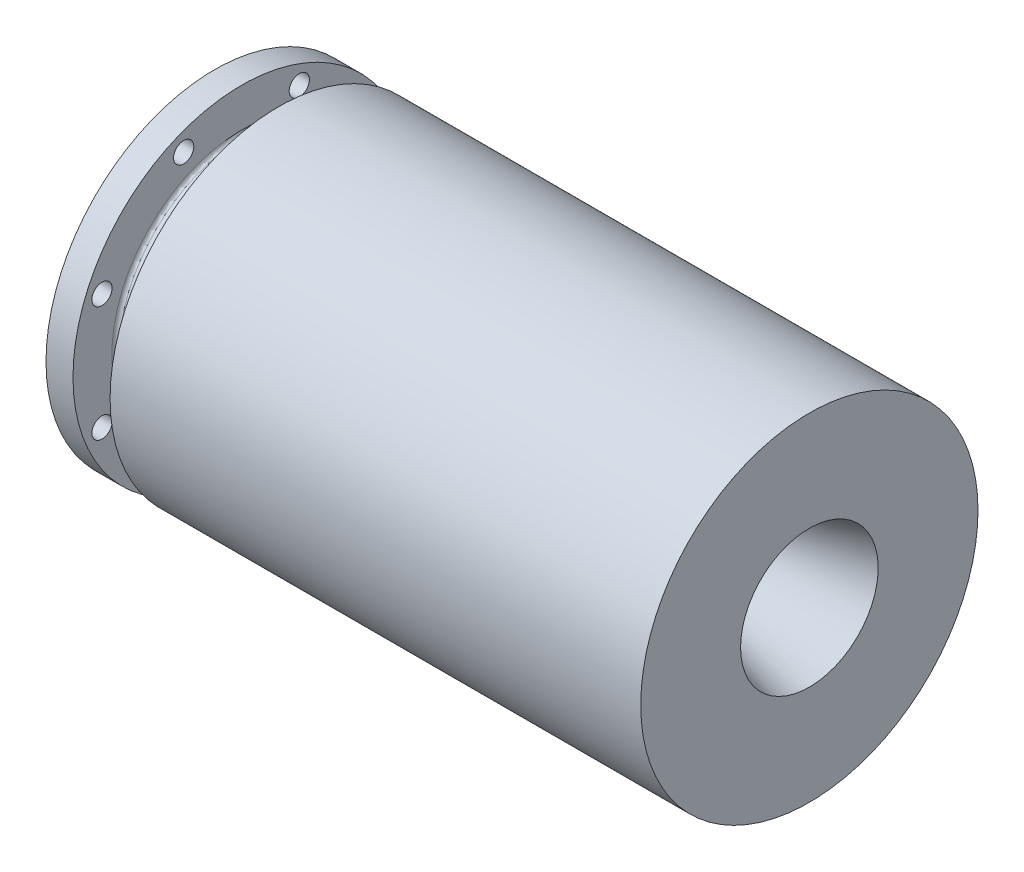
ISO-10303-21;
HEADER;
FILE_DESCRIPTION(('STEP AP214'),'2;1');
FILE_NAME('part.step','',(''),(''),'','','');
FILE_SCHEMA(('AUTOMOTIVE_DESIGN { 1 0 10303 214 1 1 1 1 }'));
ENDSEC;
DATA;
#1=APPLICATION_CONTEXT('core data for automotive mechanical design processes');
#2=APPLICATION_PROTOCOL_DEFINITION('international standard','automotive_design',2000,#1);
#3=PRODUCT_CONTEXT('',#1,'mechanical');
#4=PRODUCT('Part','Part','',(#3));
#5=PRODUCT_RELATED_PRODUCT_CATEGORY('part','',(#4));
#6=PRODUCT_DEFINITION_FORMATION('','',#4);
#7=PRODUCT_DEFINITION_CONTEXT('part definition',#1,'design');
#8=PRODUCT_DEFINITION('design','',#6,#7);
#9=PRODUCT_DEFINITION_SHAPE('','',#8);
#10=(LENGTH_UNIT() NAMED_UNIT(*) SI_UNIT(.MILLI.,.METRE.));
#11=(NAMED_UNIT(*) PLANE_ANGLE_UNIT() SI_UNIT($,.RADIAN.));
#12=(NAMED_UNIT(*) SI_UNIT($,.STERADIAN.) SOLID_ANGLE_UNIT());
#13=UNCERTAINTY_MEASURE_WITH_UNIT(LENGTH_MEASURE(1.E-05),#10,'distance_accuracy_value','');
#14=(GEOMETRIC_REPRESENTATION_CONTEXT(3) GLOBAL_UNCERTAINTY_ASSIGNED_CONTEXT((#13)) GLOBAL_UNIT_ASSIGNED_CONTEXT((#10,
#11,#12)) REPRESENTATION_CONTEXT('',''));
#15=CARTESIAN_POINT('',(0.,0.,0.));
#16=DIRECTION('',(0.,0.,1.));
#17=DIRECTION('',(1.,0.,0.));
#18=AXIS2_PLACEMENT_3D('',#15,#16,#17);
#19=CARTESIAN_POINT('',(0.,0.,0.));
#20=DIRECTION('',(-1.,0.,0.));
#21=DIRECTION('',(0.,0.,1.));
#22=AXIS2_PLACEMENT_3D('',#19,#20,#21);
#23=CYLINDRICAL_SURFACE('',#22,47.5996);
#24=CARTESIAN_POINT('',(22.86,0.,0.));
#25=DIRECTION('',(1.,0.,0.));
#26=DIRECTION('',(0.,0.,-1.));
#27=AXIS2_PLACEMENT_3D('',#24,#25,#26);
#28=CIRCLE('',#27,47.5996);
#29=CARTESIAN_POINT('',(22.86,0.,-47.5996));
#30=VERTEX_POINT('',#29);
#31=EDGE_CURVE('E63',#30,#30,#28,.F.);
#32=ORIENTED_EDGE('',*,*,#31,.T.);
#33=EDGE_LOOP('',(#32));
#34=FACE_BOUND('',#33,.T.);
#35=CARTESIAN_POINT('',(11.43,0.,0.));
#36=DIRECTION('',(-1.,0.,0.));
#37=DIRECTION('',(0.,0.,1.));
#38=AXIS2_PLACEMENT_3D('',#35,#36,#37);
#39=CIRCLE('',#38,47.5996);
#40=CARTESIAN_POINT('',(11.43,0.,47.5996));
#41=VERTEX_POINT('',#40);
#42=EDGE_CURVE('E66',#41,#41,#39,.F.);
#43=ORIENTED_EDGE('',*,*,#42,.T.);
#44=EDGE_LOOP('',(#43));
#45=FACE_BOUND('',#44,.T.);
#46=ADVANCED_FACE('F37',(#34,#45),#23,.T.);
#47=CARTESIAN_POINT('',(10.16,63.5,0.));
#48=DIRECTION('',(-1.,0.,0.));
#49=DIRECTION('',(0.,0.,1.));
#50=AXIS2_PLACEMENT_3D('',#47,#48,#49);
#51=PLANE('',#50);
#52=CARTESIAN_POINT('',(10.16,52.5460292053547,21.8190199310146));
#53=DIRECTION('',(-1.,0.,0.));
#54=DIRECTION('',(0.,0.,1.));
#55=AXIS2_PLACEMENT_3D('',#52,#53,#54);
#56=CIRCLE('',#55,3.81);
#57=CARTESIAN_POINT('',(10.16,52.5460292053547,25.6290199310146));
#58=VERTEX_POINT('',#57);
#59=EDGE_CURVE('E106',#58,#58,#56,.F.);
#60=ORIENTED_EDGE('',*,*,#59,.F.);
#61=EDGE_LOOP('',(#60));
#62=FACE_BOUND('',#61,.T.);
#63=CARTESIAN_POINT('',(10.16,21.7272766234677,52.5840305275976));
#64=DIRECTION('',(-1.,0.,0.));
#65=DIRECTION('',(0.,0.,1.));
#66=AXIS2_PLACEMENT_3D('',#63,#64,#65);
#67=CIRCLE('',#66,3.81);
#68=CARTESIAN_POINT('',(10.16,21.7272766234677,56.3940305275976));
#69=VERTEX_POINT('',#68);
#70=EDGE_CURVE('E142',#69,#69,#67,.F.);
#71=ORIENTED_EDGE('',*,*,#70,.F.);
#72=EDGE_LOOP('',(#71));
#73=FACE_BOUND('',#72,.T.);
#74=CARTESIAN_POINT('',(10.16,-21.8190199310148,52.5460292053546));
#75=DIRECTION('',(-1.,0.,0.));
#76=DIRECTION('',(0.,0.,1.));
#77=AXIS2_PLACEMENT_3D('',#74,#75,#76);
#78=CIRCLE('',#77,3.81);
#79=CARTESIAN_POINT('',(10.16,-21.8190199310148,56.3560292053546));
#80=VERTEX_POINT('',#79);
#81=EDGE_CURVE('E136',#80,#80,#78,.F.);
#82=ORIENTED_EDGE('',*,*,#81,.F.);
#83=EDGE_LOOP('',(#82));
#84=FACE_BOUND('',#83,.T.);
#85=CARTESIAN_POINT('',(10.16,-52.5840305275975,21.7272766234679));
#86=DIRECTION('',(-1.,0.,0.));
#87=DIRECTION('',(0.,0.,1.));
#88=AXIS2_PLACEMENT_3D('',#85,#86,#87);
#89=CIRCLE('',#88,3.81);
#90=CARTESIAN_POINT('',(10.16,-52.5840305275975,25.5372766234679));
#91=VERTEX_POINT('',#90);
#92=EDGE_CURVE('E130',#91,#91,#89,.F.);
#93=ORIENTED_EDGE('',*,*,#92,.F.);
#94=EDGE_LOOP('',(#93));
#95=FACE_BOUND('',#94,.T.);
#96=CARTESIAN_POINT('',(10.16,-52.5460292053545,-21.819019931015));
#97=DIRECTION('',(-1.,0.,0.));
#98=DIRECTION('',(0.,0.,1.));
#99=AXIS2_PLACEMENT_3D('',#96,#97,#98);
#100=CIRCLE('',#99,3.81);
#101=CARTESIAN_POINT('',(10.16,-52.5460292053545,-18.009019931015));
#102=VERTEX_POINT('',#101);
#103=EDGE_CURVE('E124',#102,#102,#100,.F.);
#104=ORIENTED_EDGE('',*,*,#103,.F.);
#105=EDGE_LOOP('',(#104));
#106=FACE_BOUND('',#105,.T.);
#107=CARTESIAN_POINT('',(10.16,-21.7272766234673,-52.5840305275977));
#108=DIRECTION('',(-1.,0.,0.));
#109=DIRECTION('',(0.,0.,1.));
#110=AXIS2_PLACEMENT_3D('',#107,#108,#109);
#111=CIRCLE('',#110,3.81);
#112=CARTESIAN_POINT('',(10.16,-21.7272766234673,-48.7740305275977));
#113=VERTEX_POINT('',#112);
#114=EDGE_CURVE('E118',#113,#113,#111,.F.);
#115=ORIENTED_EDGE('',*,*,#114,.F.);
#116=EDGE_LOOP('',(#115));
#117=FACE_BOUND('',#116,.T.);
#118=CARTESIAN_POINT('',(10.16,21.8190199310152,-52.5460292053544));
#119=DIRECTION('',(-1.,0.,0.));
#120=DIRECTION('',(0.,0.,1.));
#121=AXIS2_PLACEMENT_3D('',#118,#119,#120);
#122=CIRCLE('',#121,3.81);
#123=CARTESIAN_POINT('',(10.16,21.8190199310152,-48.7360292053544));
#124=VERTEX_POINT('',#123);
#125=EDGE_CURVE('E112',#124,#124,#122,.F.);
#126=ORIENTED_EDGE('',*,*,#125,.F.);
#127=EDGE_LOOP('',(#126));
#128=FACE_BOUND('',#127,.T.);
#129=CARTESIAN_POINT('',(10.16,52.5840305275975,-21.7272766234679));
#130=DIRECTION('',(-1.,0.,0.));
#131=DIRECTION('',(0.,0.,1.));
#132=AXIS2_PLACEMENT_3D('',#129,#130,#131);
#133=CIRCLE('',#132,3.81);
#134=CARTESIAN_POINT('',(10.16,52.5840305275975,-17.9172766234679));
#135=VERTEX_POINT('',#134);
#136=EDGE_CURVE('E102',#135,#135,#133,.F.);
#137=ORIENTED_EDGE('',*,*,#136,.F.);
#138=EDGE_LOOP('',(#137));
#139=FACE_BOUND('',#138,.T.);
#140=CARTESIAN_POINT('',(10.16,0.,0.));
#141=DIRECTION('',(-1.,0.,0.));
#142=DIRECTION('',(0.,0.,1.));
#143=AXIS2_PLACEMENT_3D('',#140,#141,#142);
#144=CIRCLE('',#143,48.8696);
#145=CARTESIAN_POINT('',(10.16,0.,48.8696));
#146=VERTEX_POINT('',#145);
#147=EDGE_CURVE('E57',#146,#146,#144,.T.);
#148=ORIENTED_EDGE('',*,*,#147,.T.);
#149=EDGE_LOOP('',(#148));
#150=FACE_BOUND('',#149,.T.);
#151=CARTESIAN_POINT('',(10.16,0.,0.));
#152=DIRECTION('',(-1.,0.,0.));
#153=DIRECTION('',(0.,0.,1.));
#154=AXIS2_PLACEMENT_3D('',#151,#152,#153);
#155=CIRCLE('',#154,63.5);
#156=CARTESIAN_POINT('',(10.16,0.,63.5));
#157=VERTEX_POINT('',#156);
#158=EDGE_CURVE('E69',#157,#157,#155,.T.);
#159=ORIENTED_EDGE('',*,*,#158,.F.);
#160=EDGE_LOOP('',(#159));
#161=FACE_BOUND('',#160,.T.);
#162=ADVANCED_FACE('F153',(#62,#73,#84,#95,#106,#117,#128,#139,#150,#161),#51,.F.);
#163=CARTESIAN_POINT('',(0.,0.,0.));
#164=DIRECTION('',(-1.,0.,0.));
#165=DIRECTION('',(0.,0.,1.));
#166=AXIS2_PLACEMENT_3D('',#163,#164,#165);
#167=CYLINDRICAL_SURFACE('',#166,63.5);
#168=CARTESIAN_POINT('',(0.,0.,0.));
#169=DIRECTION('',(-1.,0.,0.));
#170=DIRECTION('',(0.,0.,1.));
#171=AXIS2_PLACEMENT_3D('',#168,#169,#170);
#172=CIRCLE('',#171,63.5);
#173=CARTESIAN_POINT('',(0.,0.,63.5));
#174=VERTEX_POINT('',#173);
#175=EDGE_CURVE('E72',#174,#174,#172,.T.);
#176=ORIENTED_EDGE('',*,*,#175,.F.);
#177=EDGE_LOOP('',(#176));
#178=FACE_BOUND('',#177,.T.);
#179=ORIENTED_EDGE('',*,*,#158,.T.);
#180=EDGE_LOOP('',(#179));
#181=FACE_BOUND('',#180,.T.);
#182=ADVANCED_FACE('F156',(#178,#181),#167,.T.);
#183=CARTESIAN_POINT('',(0.,48.5902,0.));
#184=DIRECTION('',(1.,0.,0.));
#185=DIRECTION('',(0.,0.,-1.));
#186=AXIS2_PLACEMENT_3D('',#183,#184,#185);
#187=PLANE('',#186);
#188=CARTESIAN_POINT('',(0.,52.5460292053547,21.8190199310146));
#189=DIRECTION('',(-1.,0.,0.));
#190=DIRECTION('',(0.,-0.707106781186549,0.707106781186546));
#191=AXIS2_PLACEMENT_3D('',#188,#189,#190);
#192=CIRCLE('',#191,3.81);
#193=CARTESIAN_POINT('',(0.,49.8519523690339,24.5130967673354));
#194=VERTEX_POINT('',#193);
#195=EDGE_CURVE('E145',#194,#194,#192,.T.);
#196=ORIENTED_EDGE('',*,*,#195,.F.);
#197=EDGE_LOOP('',(#196));
#198=FACE_BOUND('',#197,.T.);
#199=CARTESIAN_POINT('',(0.,21.7272766234677,52.5840305275976));
#200=DIRECTION('',(-1.,0.,0.));
#201=DIRECTION('',(0.,-1.,0.));
#202=AXIS2_PLACEMENT_3D('',#199,#200,#201);
#203=CIRCLE('',#202,3.81);
#204=CARTESIAN_POINT('',(0.,17.9172766234677,52.5840305275976));
#205=VERTEX_POINT('',#204);
#206=EDGE_CURVE('E139',#205,#205,#203,.T.);
#207=ORIENTED_EDGE('',*,*,#206,.F.);
#208=EDGE_LOOP('',(#207));
#209=FACE_BOUND('',#208,.T.);
#210=CARTESIAN_POINT('',(0.,-21.8190199310148,52.5460292053546));
#211=DIRECTION('',(-1.,0.,0.));
#212=DIRECTION('',(0.,-0.707106781186544,-0.707106781186551));
#213=AXIS2_PLACEMENT_3D('',#210,#211,#212);
#214=CIRCLE('',#213,3.81);
#215=CARTESIAN_POINT('',(0.,-24.5130967673356,49.8519523690338));
#216=VERTEX_POINT('',#215);
#217=EDGE_CURVE('E133',#216,#216,#214,.T.);
#218=ORIENTED_EDGE('',*,*,#217,.F.);
#219=EDGE_LOOP('',(#218));
#220=FACE_BOUND('',#219,.T.);
#221=CARTESIAN_POINT('',(0.,-52.5840305275975,21.7272766234679));
#222=DIRECTION('',(-1.,0.,0.));
#223=DIRECTION('',(0.,0.,-1.));
#224=AXIS2_PLACEMENT_3D('',#221,#222,#223);
#225=CIRCLE('',#224,3.81);
#226=CARTESIAN_POINT('',(0.,-52.5840305275975,17.9172766234679));
#227=VERTEX_POINT('',#226);
#228=EDGE_CURVE('E127',#227,#227,#225,.T.);
#229=ORIENTED_EDGE('',*,*,#228,.F.);
#230=EDGE_LOOP('',(#229));
#231=FACE_BOUND('',#230,.T.);
#232=CARTESIAN_POINT('',(0.,-52.5460292053545,-21.819019931015));
#233=DIRECTION('',(-1.,0.,0.));
#234=DIRECTION('',(0.,0.707106781186554,-0.707106781186541));
#235=AXIS2_PLACEMENT_3D('',#232,#233,#234);
#236=CIRCLE('',#235,3.81);
#237=CARTESIAN_POINT('',(0.,-49.8519523690338,-24.5130967673357));
#238=VERTEX_POINT('',#237);
#239=EDGE_CURVE('E121',#238,#238,#236,.T.);
#240=ORIENTED_EDGE('',*,*,#239,.F.);
#241=EDGE_LOOP('',(#240));
#242=FACE_BOUND('',#241,.T.);
#243=CARTESIAN_POINT('',(0.,-21.7272766234673,-52.5840305275977));
#244=DIRECTION('',(-1.,0.,0.));
#245=DIRECTION('',(0.,1.,0.));
#246=AXIS2_PLACEMENT_3D('',#243,#244,#245);
#247=CIRCLE('',#246,3.81);
#248=CARTESIAN_POINT('',(0.,-17.9172766234673,-52.5840305275977));
#249=VERTEX_POINT('',#248);
#250=EDGE_CURVE('E115',#249,#249,#247,.T.);
#251=ORIENTED_EDGE('',*,*,#250,.F.);
#252=EDGE_LOOP('',(#251));
#253=FACE_BOUND('',#252,.T.);
#254=CARTESIAN_POINT('',(0.,21.8190199310152,-52.5460292053544));
#255=DIRECTION('',(-1.,0.,0.));
#256=DIRECTION('',(0.,0.707106781186539,0.707106781186556));
#257=AXIS2_PLACEMENT_3D('',#254,#255,#256);
#258=CIRCLE('',#257,3.81);
#259=CARTESIAN_POINT('',(0.,24.5130967673359,-49.8519523690337));
#260=VERTEX_POINT('',#259);
#261=EDGE_CURVE('E109',#260,#260,#258,.T.);
#262=ORIENTED_EDGE('',*,*,#261,.F.);
#263=EDGE_LOOP('',(#262));
#264=FACE_BOUND('',#263,.T.);
#265=CARTESIAN_POINT('',(0.,52.5840305275975,-21.7272766234679));
#266=DIRECTION('',(-1.,0.,0.));
#267=DIRECTION('',(0.,0.,1.));
#268=AXIS2_PLACEMENT_3D('',#265,#266,#267);
#269=CIRCLE('',#268,3.81);
#270=CARTESIAN_POINT('',(0.,52.5840305275975,-17.9172766234679));
#271=VERTEX_POINT('',#270);
#272=EDGE_CURVE('E103',#271,#271,#269,.T.);
#273=ORIENTED_EDGE('',*,*,#272,.F.);
#274=EDGE_LOOP('',(#273));
#275=FACE_BOUND('',#274,.T.);
#276=CARTESIAN_POINT('',(0.,0.,0.));
#277=DIRECTION('',(-1.,0.,0.));
#278=DIRECTION('',(0.,0.,1.));
#279=AXIS2_PLACEMENT_3D('',#276,#277,#278);
#280=CIRCLE('',#279,48.5902);
#281=CARTESIAN_POINT('',(0.,0.,48.5902));
#282=VERTEX_POINT('',#281);
#283=EDGE_CURVE('E75',#282,#282,#280,.T.);
#284=ORIENTED_EDGE('',*,*,#283,.F.);
#285=EDGE_LOOP('',(#284));
#286=FACE_BOUND('',#285,.T.);
#287=ORIENTED_EDGE('',*,*,#175,.T.);
#288=EDGE_LOOP('',(#287));
#289=FACE_BOUND('',#288,.T.);
#290=ADVANCED_FACE('F177',(#198,#209,#220,#231,#242,#253,#264,#275,#286,#289),#187,.F.);
#291=CARTESIAN_POINT('',(0.,0.,0.));
#292=DIRECTION('',(-1.,0.,0.));
#293=DIRECTION('',(0.,0.,1.));
#294=AXIS2_PLACEMENT_3D('',#291,#292,#293);
#295=CYLINDRICAL_SURFACE('',#294,48.5902);
#296=CARTESIAN_POINT('',(2.9718,0.,0.));
#297=DIRECTION('',(1.,0.,0.));
#298=DIRECTION('',(0.,0.,-1.));
#299=AXIS2_PLACEMENT_3D('',#296,#297,#298);
#300=CIRCLE('',#299,48.5902);
#301=CARTESIAN_POINT('',(2.9718,0.,-48.5902));
#302=VERTEX_POINT('',#301);
#303=EDGE_CURVE('E10',#302,#302,#300,.T.);
#304=ORIENTED_EDGE('',*,*,#303,.T.);
#305=EDGE_LOOP('',(#304));
#306=FACE_BOUND('',#305,.T.);
#307=ORIENTED_EDGE('',*,*,#283,.T.);
#308=EDGE_LOOP('',(#307));
#309=FACE_BOUND('',#308,.T.);
#310=ADVANCED_FACE('F183',(#306,#309),#295,.F.);
#311=CARTESIAN_POINT('',(3.8608,48.5902,0.));
#312=DIRECTION('',(1.,0.,0.));
#313=DIRECTION('',(0.,0.,-1.));
#314=AXIS2_PLACEMENT_3D('',#311,#312,#313);
#315=PLANE('',#314);
#316=CARTESIAN_POINT('',(3.8608,0.,0.));
#317=DIRECTION('',(1.,0.,0.));
#318=DIRECTION('',(0.,0.,-1.));
#319=AXIS2_PLACEMENT_3D('',#316,#317,#318);
#320=CIRCLE('',#319,43.4086);
#321=CARTESIAN_POINT('',(3.8608,0.,-43.4086));
#322=VERTEX_POINT('',#321);
#323=EDGE_CURVE('E44',#322,#322,#320,.T.);
#324=ORIENTED_EDGE('',*,*,#323,.T.);
#325=EDGE_LOOP('',(#324));
#326=FACE_BOUND('',#325,.T.);
#327=CARTESIAN_POINT('',(3.8608,0.,0.));
#328=DIRECTION('',(1.,0.,0.));
#329=DIRECTION('',(0.,0.,-1.));
#330=AXIS2_PLACEMENT_3D('',#327,#328,#329);
#331=CIRCLE('',#330,47.7012);
#332=CARTESIAN_POINT('',(3.8608,0.,-47.7012));
#333=VERTEX_POINT('',#332);
#334=EDGE_CURVE('E48',#333,#333,#331,.F.);
#335=ORIENTED_EDGE('',*,*,#334,.T.);
#336=EDGE_LOOP('',(#335));
#337=FACE_BOUND('',#336,.T.);
#338=ADVANCED_FACE('F221',(#326,#337),#315,.F.);
#339=CARTESIAN_POINT('',(0.,0.,0.));
#340=DIRECTION('',(-1.,0.,0.));
#341=DIRECTION('',(0.,0.,1.));
#342=AXIS2_PLACEMENT_3D('',#339,#340,#341);
#343=CYLINDRICAL_SURFACE('',#342,42.5196);
#344=CARTESIAN_POINT('',(2.9718,0.,0.));
#345=DIRECTION('',(1.,0.,0.));
#346=DIRECTION('',(0.,0.,-1.));
#347=AXIS2_PLACEMENT_3D('',#344,#345,#346);
#348=CIRCLE('',#347,42.5196);
#349=CARTESIAN_POINT('',(2.9718,0.,-42.5196));
#350=VERTEX_POINT('',#349);
#351=EDGE_CURVE('E52',#350,#350,#348,.F.);
#352=ORIENTED_EDGE('',*,*,#351,.T.);
#353=EDGE_LOOP('',(#352));
#354=FACE_BOUND('',#353,.T.);
#355=CARTESIAN_POINT('',(0.,0.,0.));
#356=DIRECTION('',(-1.,0.,0.));
#357=DIRECTION('',(0.,0.,1.));
#358=AXIS2_PLACEMENT_3D('',#355,#356,#357);
#359=CIRCLE('',#358,42.5196);
#360=CARTESIAN_POINT('',(0.,0.,42.5196));
#361=VERTEX_POINT('',#360);
#362=EDGE_CURVE('E78',#361,#361,#359,.T.);
#363=ORIENTED_EDGE('',*,*,#362,.F.);
#364=EDGE_LOOP('',(#363));
#365=FACE_BOUND('',#364,.T.);
#366=ADVANCED_FACE('F217',(#354,#365),#343,.T.);
#367=CARTESIAN_POINT('',(0.,33.8836,0.));
#368=DIRECTION('',(1.,0.,0.));
#369=DIRECTION('',(0.,0.,-1.));
#370=AXIS2_PLACEMENT_3D('',#367,#368,#369);
#371=PLANE('',#370);
#372=CARTESIAN_POINT('',(0.,0.,0.));
#373=DIRECTION('',(-1.,0.,0.));
#374=DIRECTION('',(0.,0.,1.));
#375=AXIS2_PLACEMENT_3D('',#372,#373,#374);
#376=CIRCLE('',#375,33.8836);
#377=CARTESIAN_POINT('',(0.,0.,33.8836));
#378=VERTEX_POINT('',#377);
#379=EDGE_CURVE('E81',#378,#378,#376,.T.);
#380=ORIENTED_EDGE('',*,*,#379,.F.);
#381=EDGE_LOOP('',(#380));
#382=FACE_BOUND('',#381,.T.);
#383=ORIENTED_EDGE('',*,*,#362,.T.);
#384=EDGE_LOOP('',(#383));
#385=FACE_BOUND('',#384,.T.);
#386=ADVANCED_FACE('F220',(#382,#385),#371,.F.);
#387=CARTESIAN_POINT('',(0.,0.,0.));
#388=DIRECTION('',(-1.,0.,0.));
#389=DIRECTION('',(0.,0.,1.));
#390=AXIS2_PLACEMENT_3D('',#387,#388,#389);
#391=CYLINDRICAL_SURFACE('',#390,33.8836);
#392=CARTESIAN_POINT('',(173.5582,0.,0.));
#393=DIRECTION('',(-1.,0.,0.));
#394=DIRECTION('',(0.,0.,1.));
#395=AXIS2_PLACEMENT_3D('',#392,#393,#394);
#396=CIRCLE('',#395,33.8836);
#397=CARTESIAN_POINT('',(173.5582,0.,33.8836));
#398=VERTEX_POINT('',#397);
#399=EDGE_CURVE('E84',#398,#398,#396,.T.);
#400=ORIENTED_EDGE('',*,*,#399,.F.);
#401=EDGE_LOOP('',(#400));
#402=FACE_BOUND('',#401,.T.);
#403=ORIENTED_EDGE('',*,*,#379,.T.);
#404=EDGE_LOOP('',(#403));
#405=FACE_BOUND('',#404,.T.);
#406=ADVANCED_FACE('F226',(#402,#405),#391,.F.);
#407=CARTESIAN_POINT('',(173.5582,0.,0.));
#408=DIRECTION('',(-1.,0.,0.));
#409=DIRECTION('',(0.,0.,1.));
#410=AXIS2_PLACEMENT_3D('',#407,#408,#409);
#411=CONICAL_SURFACE('',#410,33.8836,0.785398163397442);
#412=CARTESIAN_POINT('',(189.463049342222,0.,0.));
#413=DIRECTION('',(-1.,0.,0.));
#414=DIRECTION('',(0.,0.,1.));
#415=AXIS2_PLACEMENT_3D('',#412,#413,#414);
#416=CIRCLE('',#415,17.9787506577782);
#417=CARTESIAN_POINT('',(189.463049342222,0.,17.9787506577782));
#418=VERTEX_POINT('',#417);
#419=EDGE_CURVE('E87',#418,#418,#416,.T.);
#420=ORIENTED_EDGE('',*,*,#419,.F.);
#421=EDGE_LOOP('',(#420));
#422=FACE_BOUND('',#421,.T.);
#423=ORIENTED_EDGE('',*,*,#399,.T.);
#424=EDGE_LOOP('',(#423));
#425=FACE_BOUND('',#424,.T.);
#426=ADVANCED_FACE('F232',(#422,#425),#411,.F.);
#427=CARTESIAN_POINT('',(191.259100566436,0.,0.));
#428=DIRECTION('',(-1.,0.,0.));
#429=DIRECTION('',(0.,0.,1.));
#430=AXIS2_PLACEMENT_3D('',#427,#428,#429);
#431=TOROIDAL_SURFACE('',#430,19.774801881992,2.54);
#432=CARTESIAN_POINT('',(191.916500940996,0.,0.));
#433=DIRECTION('',(-1.,0.,0.));
#434=DIRECTION('',(0.,0.,1.));
#435=AXIS2_PLACEMENT_3D('',#432,#433,#434);
#436=CIRCLE('',#435,17.3213502832178);
#437=CARTESIAN_POINT('',(191.916500940996,0.,17.3213502832178));
#438=VERTEX_POINT('',#437);
#439=EDGE_CURVE('E90',#438,#438,#436,.T.);
#440=ORIENTED_EDGE('',*,*,#439,.F.);
#441=EDGE_LOOP('',(#440));
#442=FACE_BOUND('',#441,.T.);
#443=ORIENTED_EDGE('',*,*,#419,.T.);
#444=EDGE_LOOP('',(#443));
#445=FACE_BOUND('',#444,.T.);
#446=ADVANCED_FACE('F283',(#442,#445),#431,.T.);
#447=CARTESIAN_POINT('',(191.916500940996,0.,0.));
#448=DIRECTION('',(1.,0.,0.));
#449=DIRECTION('',(0.,0.,-1.));
#450=AXIS2_PLACEMENT_3D('',#447,#448,#449);
#451=CONICAL_SURFACE('',#450,17.3213502832178,0.26179938779915);
#452=CARTESIAN_POINT('',(223.962313950824,0.,0.));
#453=DIRECTION('',(-1.,0.,0.));
#454=DIRECTION('',(0.,0.,1.));
#455=AXIS2_PLACEMENT_3D('',#452,#453,#454);
#456=CIRCLE('',#455,25.908);
#457=CARTESIAN_POINT('',(223.962313950824,0.,25.908));
#458=VERTEX_POINT('',#457);
#459=EDGE_CURVE('E93',#458,#458,#456,.T.);
#460=ORIENTED_EDGE('',*,*,#459,.F.);
#461=EDGE_LOOP('',(#460));
#462=FACE_BOUND('',#461,.T.);
#463=ORIENTED_EDGE('',*,*,#439,.T.);
#464=EDGE_LOOP('',(#463));
#465=FACE_BOUND('',#464,.T.);
#466=ADVANCED_FACE('F293',(#462,#465),#451,.F.);
#467=CARTESIAN_POINT('',(223.962313950824,63.5,0.));
#468=DIRECTION('',(-1.,0.,0.));
#469=DIRECTION('',(0.,0.,1.));
#470=AXIS2_PLACEMENT_3D('',#467,#468,#469);
#471=PLANE('',#470);
#472=CARTESIAN_POINT('',(223.962313950824,0.,0.));
#473=DIRECTION('',(-1.,0.,0.));
#474=DIRECTION('',(0.,0.,1.));
#475=AXIS2_PLACEMENT_3D('',#472,#473,#474);
#476=CIRCLE('',#475,63.5);
#477=CARTESIAN_POINT('',(223.962313950824,0.,63.5));
#478=VERTEX_POINT('',#477);
#479=EDGE_CURVE('E96',#478,#478,#476,.T.);
#480=ORIENTED_EDGE('',*,*,#479,.F.);
#481=EDGE_LOOP('',(#480));
#482=FACE_BOUND('',#481,.T.);
#483=ORIENTED_EDGE('',*,*,#459,.T.);
#484=EDGE_LOOP('',(#483));
#485=FACE_BOUND('',#484,.T.);
#486=ADVANCED_FACE('F304',(#482,#485),#471,.F.);
#487=CARTESIAN_POINT('',(0.,0.,0.));
#488=DIRECTION('',(-1.,0.,0.));
#489=DIRECTION('',(0.,0.,1.));
#490=AXIS2_PLACEMENT_3D('',#487,#488,#489);
#491=CYLINDRICAL_SURFACE('',#490,63.5);
#492=CARTESIAN_POINT('',(24.13,0.,0.));
#493=DIRECTION('',(-1.,0.,0.));
#494=DIRECTION('',(0.,0.,1.));
#495=AXIS2_PLACEMENT_3D('',#492,#493,#494);
#496=CIRCLE('',#495,63.5);
#497=CARTESIAN_POINT('',(24.13,0.,63.5));
#498=VERTEX_POINT('',#497);
#499=EDGE_CURVE('E99',#498,#498,#496,.T.);
#500=ORIENTED_EDGE('',*,*,#499,.F.);
#501=EDGE_LOOP('',(#500));
#502=FACE_BOUND('',#501,.T.);
#503=ORIENTED_EDGE('',*,*,#479,.T.);
#504=EDGE_LOOP('',(#503));
#505=FACE_BOUND('',#504,.T.);
#506=ADVANCED_FACE('F315',(#502,#505),#491,.T.);
#507=CARTESIAN_POINT('',(24.13,47.5996,0.));
#508=DIRECTION('',(1.,0.,0.));
#509=DIRECTION('',(0.,0.,-1.));
#510=AXIS2_PLACEMENT_3D('',#507,#508,#509);
#511=PLANE('',#510);
#512=CARTESIAN_POINT('',(24.13,0.,0.));
#513=DIRECTION('',(1.,0.,0.));
#514=DIRECTION('',(0.,0.,-1.));
#515=AXIS2_PLACEMENT_3D('',#512,#513,#514);
#516=CIRCLE('',#515,48.8696);
#517=CARTESIAN_POINT('',(24.13,0.,-48.8696));
#518=VERTEX_POINT('',#517);
#519=EDGE_CURVE('E60',#518,#518,#516,.T.);
#520=ORIENTED_EDGE('',*,*,#519,.T.);
#521=EDGE_LOOP('',(#520));
#522=FACE_BOUND('',#521,.T.);
#523=ORIENTED_EDGE('',*,*,#499,.T.);
#524=EDGE_LOOP('',(#523));
#525=FACE_BOUND('',#524,.T.);
#526=ADVANCED_FACE('F198',(#522,#525),#511,.F.);
#527=CARTESIAN_POINT('',(22.86,0.,0.));
#528=DIRECTION('',(1.,0.,0.));
#529=DIRECTION('',(0.,0.,-1.));
#530=AXIS2_PLACEMENT_3D('',#527,#528,#529);
#531=TOROIDAL_SURFACE('',#530,48.8696,1.27);
#532=ORIENTED_EDGE('',*,*,#519,.F.);
#533=EDGE_LOOP('',(#532));
#534=FACE_BOUND('',#533,.T.);
#535=ORIENTED_EDGE('',*,*,#31,.F.);
#536=EDGE_LOOP('',(#535));
#537=FACE_BOUND('',#536,.T.);
#538=ADVANCED_FACE('F194',(#534,#537),#531,.F.);
#539=CARTESIAN_POINT('',(11.43,0.,0.));
#540=DIRECTION('',(-1.,0.,0.));
#541=DIRECTION('',(0.,0.,1.));
#542=AXIS2_PLACEMENT_3D('',#539,#540,#541);
#543=TOROIDAL_SURFACE('',#542,48.8696,1.27);
#544=ORIENTED_EDGE('',*,*,#42,.F.);
#545=EDGE_LOOP('',(#544));
#546=FACE_BOUND('',#545,.T.);
#547=ORIENTED_EDGE('',*,*,#147,.F.);
#548=EDGE_LOOP('',(#547));
#549=FACE_BOUND('',#548,.T.);
#550=ADVANCED_FACE('F197',(#546,#549),#543,.F.);
#551=CARTESIAN_POINT('',(223.963313950824,52.5840305275975,-21.7272766234679));
#552=DIRECTION('',(-1.,0.,0.));
#553=DIRECTION('',(0.,0.,1.));
#554=AXIS2_PLACEMENT_3D('',#551,#552,#553);
#555=CYLINDRICAL_SURFACE('',#554,3.81);
#556=ORIENTED_EDGE('',*,*,#272,.T.);
#557=EDGE_LOOP('',(#556));
#558=FACE_BOUND('',#557,.T.);
#559=ORIENTED_EDGE('',*,*,#136,.T.);
#560=EDGE_LOOP('',(#559));
#561=FACE_BOUND('',#560,.T.);
#562=ADVANCED_FACE('F201',(#558,#561),#555,.F.);
#563=CARTESIAN_POINT('',(223.963313950824,21.8190199310152,-52.5460292053544));
#564=DIRECTION('',(-1.,0.,0.));
#565=DIRECTION('',(0.,0.,1.));
#566=AXIS2_PLACEMENT_3D('',#563,#564,#565);
#567=CYLINDRICAL_SURFACE('',#566,3.81);
#568=ORIENTED_EDGE('',*,*,#261,.T.);
#569=EDGE_LOOP('',(#568));
#570=FACE_BOUND('',#569,.T.);
#571=ORIENTED_EDGE('',*,*,#125,.T.);
#572=EDGE_LOOP('',(#571));
#573=FACE_BOUND('',#572,.T.);
#574=ADVANCED_FACE('F362',(#570,#573),#567,.F.);
#575=CARTESIAN_POINT('',(223.963313950824,-21.7272766234673,-52.5840305275977));
#576=DIRECTION('',(-1.,0.,0.));
#577=DIRECTION('',(0.,0.,1.));
#578=AXIS2_PLACEMENT_3D('',#575,#576,#577);
#579=CYLINDRICAL_SURFACE('',#578,3.81);
#580=ORIENTED_EDGE('',*,*,#250,.T.);
#581=EDGE_LOOP('',(#580));
#582=FACE_BOUND('',#581,.T.);
#583=ORIENTED_EDGE('',*,*,#114,.T.);
#584=EDGE_LOOP('',(#583));
#585=FACE_BOUND('',#584,.T.);
#586=ADVANCED_FACE('F373',(#582,#585),#579,.F.);
#587=CARTESIAN_POINT('',(223.963313950824,-52.5460292053545,-21.819019931015));
#588=DIRECTION('',(-1.,0.,0.));
#589=DIRECTION('',(0.,0.,1.));
#590=AXIS2_PLACEMENT_3D('',#587,#588,#589);
#591=CYLINDRICAL_SURFACE('',#590,3.81);
#592=ORIENTED_EDGE('',*,*,#239,.T.);
#593=EDGE_LOOP('',(#592));
#594=FACE_BOUND('',#593,.T.);
#595=ORIENTED_EDGE('',*,*,#103,.T.);
#596=EDGE_LOOP('',(#595));
#597=FACE_BOUND('',#596,.T.);
#598=ADVANCED_FACE('F384',(#594,#597),#591,.F.);
#599=CARTESIAN_POINT('',(223.963313950824,-52.5840305275975,21.7272766234679));
#600=DIRECTION('',(-1.,0.,0.));
#601=DIRECTION('',(0.,0.,1.));
#602=AXIS2_PLACEMENT_3D('',#599,#600,#601);
#603=CYLINDRICAL_SURFACE('',#602,3.81);
#604=ORIENTED_EDGE('',*,*,#228,.T.);
#605=EDGE_LOOP('',(#604));
#606=FACE_BOUND('',#605,.T.);
#607=ORIENTED_EDGE('',*,*,#92,.T.);
#608=EDGE_LOOP('',(#607));
#609=FACE_BOUND('',#608,.T.);
#610=ADVANCED_FACE('F395',(#606,#609),#603,.F.);
#611=CARTESIAN_POINT('',(223.963313950824,-21.8190199310148,52.5460292053546));
#612=DIRECTION('',(-1.,0.,0.));
#613=DIRECTION('',(0.,0.,1.));
#614=AXIS2_PLACEMENT_3D('',#611,#612,#613);
#615=CYLINDRICAL_SURFACE('',#614,3.81);
#616=ORIENTED_EDGE('',*,*,#217,.T.);
#617=EDGE_LOOP('',(#616));
#618=FACE_BOUND('',#617,.T.);
#619=ORIENTED_EDGE('',*,*,#81,.T.);
#620=EDGE_LOOP('',(#619));
#621=FACE_BOUND('',#620,.T.);
#622=ADVANCED_FACE('F406',(#618,#621),#615,.F.);
#623=CARTESIAN_POINT('',(223.963313950824,21.7272766234677,52.5840305275976));
#624=DIRECTION('',(-1.,0.,0.));
#625=DIRECTION('',(0.,0.,1.));
#626=AXIS2_PLACEMENT_3D('',#623,#624,#625);
#627=CYLINDRICAL_SURFACE('',#626,3.81);
#628=ORIENTED_EDGE('',*,*,#206,.T.);
#629=EDGE_LOOP('',(#628));
#630=FACE_BOUND('',#629,.T.);
#631=ORIENTED_EDGE('',*,*,#70,.T.);
#632=EDGE_LOOP('',(#631));
#633=FACE_BOUND('',#632,.T.);
#634=ADVANCED_FACE('F211',(#630,#633),#627,.F.);
#635=CARTESIAN_POINT('',(223.963313950824,52.5460292053547,21.8190199310146));
#636=DIRECTION('',(-1.,0.,0.));
#637=DIRECTION('',(0.,0.,1.));
#638=AXIS2_PLACEMENT_3D('',#635,#636,#637);
#639=CYLINDRICAL_SURFACE('',#638,3.81);
#640=ORIENTED_EDGE('',*,*,#195,.T.);
#641=EDGE_LOOP('',(#640));
#642=FACE_BOUND('',#641,.T.);
#643=ORIENTED_EDGE('',*,*,#59,.T.);
#644=EDGE_LOOP('',(#643));
#645=FACE_BOUND('',#644,.T.);
#646=ADVANCED_FACE('F151',(#642,#645),#639,.F.);
#647=CARTESIAN_POINT('',(2.9718,0.,0.));
#648=DIRECTION('',(1.,0.,0.));
#649=DIRECTION('',(0.,0.,-1.));
#650=AXIS2_PLACEMENT_3D('',#647,#648,#649);
#651=TOROIDAL_SURFACE('',#650,43.4086,0.889);
#652=ORIENTED_EDGE('',*,*,#323,.F.);
#653=EDGE_LOOP('',(#652));
#654=FACE_BOUND('',#653,.T.);
#655=ORIENTED_EDGE('',*,*,#351,.F.);
#656=EDGE_LOOP('',(#655));
#657=FACE_BOUND('',#656,.T.);
#658=ADVANCED_FACE('F203',(#654,#657),#651,.F.);
#659=CARTESIAN_POINT('',(2.9718,0.,0.));
#660=DIRECTION('',(1.,0.,0.));
#661=DIRECTION('',(0.,0.,-1.));
#662=AXIS2_PLACEMENT_3D('',#659,#660,#661);
#663=TOROIDAL_SURFACE('',#662,47.7012,0.889);
#664=ORIENTED_EDGE('',*,*,#303,.F.);
#665=EDGE_LOOP('',(#664));
#666=FACE_BOUND('',#665,.T.);
#667=ORIENTED_EDGE('',*,*,#334,.F.);
#668=EDGE_LOOP('',(#667));
#669=FACE_BOUND('',#668,.T.);
#670=ADVANCED_FACE('F39',(#666,#669),#663,.F.);
#671=CLOSED_SHELL('',(#46,#162,#182,#290,#310,#338,#366,#386,#406,#426,#446,#466,#486,#506,#526,
#538,#550,#562,#574,#586,#598,#610,#622,#634,#646,#658,#670));
#672=MANIFOLD_SOLID_BREP('B2',#671);
#673=ADVANCED_BREP_SHAPE_REPRESENTATION('',(#18,#672),#14);
#674=SHAPE_DEFINITION_REPRESENTATION(#9,#673);
ENDSEC;
END-ISO-10303-21;
